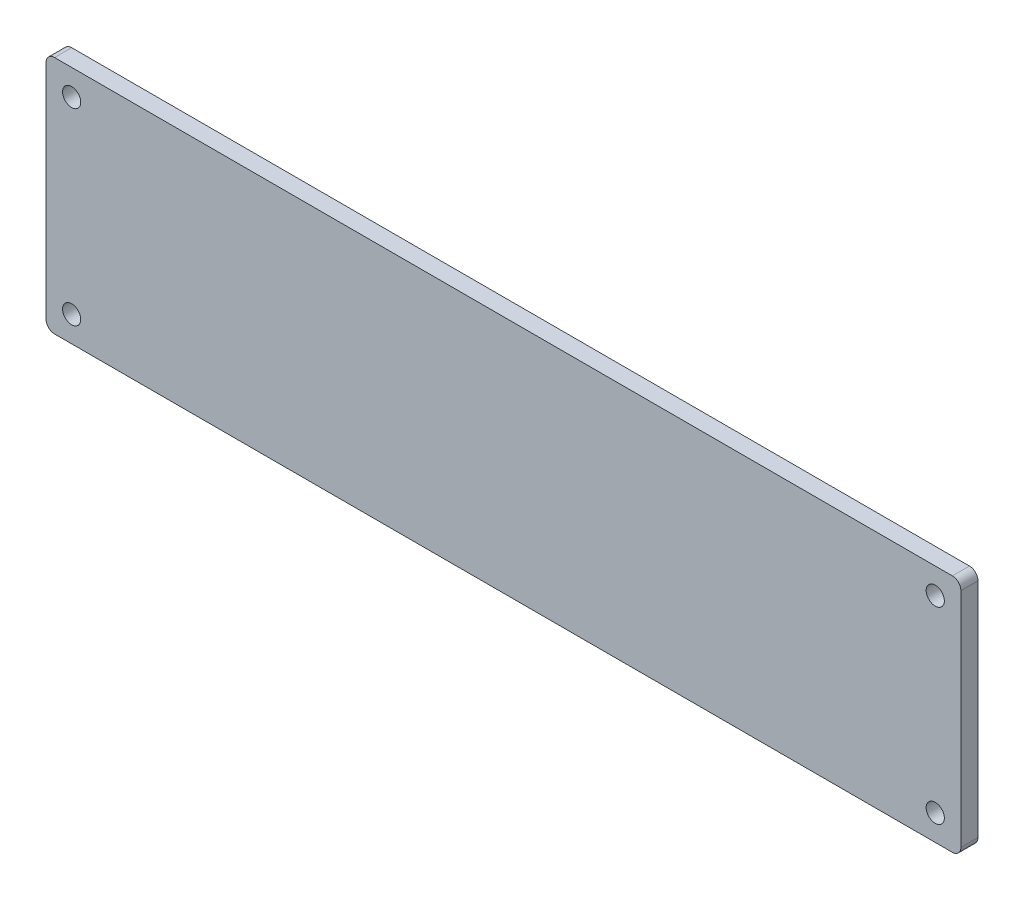
ISO-10303-21;
HEADER;
FILE_DESCRIPTION(('STEP AP214'),'2;1');
FILE_NAME('part.step','',(''),(''),'','','');
FILE_SCHEMA(('AUTOMOTIVE_DESIGN { 1 0 10303 214 1 1 1 1 }'));
ENDSEC;
DATA;
#1=APPLICATION_CONTEXT('core data for automotive mechanical design processes');
#2=APPLICATION_PROTOCOL_DEFINITION('international standard','automotive_design',2000,#1);
#3=PRODUCT_CONTEXT('',#1,'mechanical');
#4=PRODUCT('Part','Part','',(#3));
#5=PRODUCT_RELATED_PRODUCT_CATEGORY('part','',(#4));
#6=PRODUCT_DEFINITION_FORMATION('','',#4);
#7=PRODUCT_DEFINITION_CONTEXT('part definition',#1,'design');
#8=PRODUCT_DEFINITION('design','',#6,#7);
#9=PRODUCT_DEFINITION_SHAPE('','',#8);
#10=(LENGTH_UNIT() NAMED_UNIT(*) SI_UNIT(.MILLI.,.METRE.));
#11=(NAMED_UNIT(*) PLANE_ANGLE_UNIT() SI_UNIT($,.RADIAN.));
#12=(NAMED_UNIT(*) SI_UNIT($,.STERADIAN.) SOLID_ANGLE_UNIT());
#13=UNCERTAINTY_MEASURE_WITH_UNIT(LENGTH_MEASURE(1.E-05),#10,'distance_accuracy_value','');
#14=(GEOMETRIC_REPRESENTATION_CONTEXT(3) GLOBAL_UNCERTAINTY_ASSIGNED_CONTEXT((#13)) GLOBAL_UNIT_ASSIGNED_CONTEXT((#10,
#11,#12)) REPRESENTATION_CONTEXT('',''));
#15=CARTESIAN_POINT('',(0.,0.,0.));
#16=DIRECTION('',(0.,0.,1.));
#17=DIRECTION('',(1.,0.,0.));
#18=AXIS2_PLACEMENT_3D('',#15,#16,#17);
#19=CARTESIAN_POINT('',(169.8625,44.45,6.35));
#20=DIRECTION('',(1.,0.,0.));
#21=DIRECTION('',(0.,0.,-1.));
#22=AXIS2_PLACEMENT_3D('',#19,#20,#21);
#23=PLANE('',#22);
#24=DIRECTION('',(0.,-1.,0.));
#25=VECTOR('',#24,1.);
#26=CARTESIAN_POINT('',(169.8625,44.45,0.));
#27=LINE('',#26,#25);
#28=CARTESIAN_POINT('',(169.8625,41.275,0.));
#29=VERTEX_POINT('',#28);
#30=CARTESIAN_POINT('',(169.8625,-41.275,0.));
#31=VERTEX_POINT('',#30);
#32=EDGE_CURVE('E165',#29,#31,#27,.T.);
#33=ORIENTED_EDGE('',*,*,#32,.F.);
#34=DIRECTION('',(0.,0.,-1.));
#35=VECTOR('',#34,1.);
#36=CARTESIAN_POINT('',(169.8625,41.275,6.35));
#37=LINE('',#36,#35);
#38=CARTESIAN_POINT('',(169.8625,41.275,6.35));
#39=VERTEX_POINT('',#38);
#40=EDGE_CURVE('E140',#29,#39,#37,.F.);
#41=ORIENTED_EDGE('',*,*,#40,.T.);
#42=DIRECTION('',(0.,-1.,0.));
#43=VECTOR('',#42,1.);
#44=CARTESIAN_POINT('',(169.8625,44.45,6.35));
#45=LINE('',#44,#43);
#46=CARTESIAN_POINT('',(169.8625,-41.275,6.35));
#47=VERTEX_POINT('',#46);
#48=EDGE_CURVE('E121',#39,#47,#45,.T.);
#49=ORIENTED_EDGE('',*,*,#48,.T.);
#50=DIRECTION('',(0.,0.,-1.));
#51=VECTOR('',#50,1.);
#52=CARTESIAN_POINT('',(169.8625,-41.275,6.35));
#53=LINE('',#52,#51);
#54=EDGE_CURVE('E137',#47,#31,#53,.T.);
#55=ORIENTED_EDGE('',*,*,#54,.T.);
#56=EDGE_LOOP('',(#33,#41,#49,#55));
#57=FACE_BOUND('',#56,.T.);
#58=ADVANCED_FACE('F34',(#57),#23,.T.);
#59=CARTESIAN_POINT('',(-169.8625,44.45,6.35));
#60=DIRECTION('',(0.,1.,0.));
#61=DIRECTION('',(0.,0.,1.));
#62=AXIS2_PLACEMENT_3D('',#59,#60,#61);
#63=PLANE('',#62);
#64=DIRECTION('',(1.,0.,0.));
#65=VECTOR('',#64,1.);
#66=CARTESIAN_POINT('',(-169.8625,44.45,6.35));
#67=LINE('',#66,#65);
#68=CARTESIAN_POINT('',(-166.6875,44.45,6.35));
#69=VERTEX_POINT('',#68);
#70=CARTESIAN_POINT('',(166.6875,44.45,6.35));
#71=VERTEX_POINT('',#70);
#72=EDGE_CURVE('E126',#69,#71,#67,.T.);
#73=ORIENTED_EDGE('',*,*,#72,.T.);
#74=DIRECTION('',(0.,0.,-1.));
#75=VECTOR('',#74,1.);
#76=CARTESIAN_POINT('',(166.6875,44.45,6.35));
#77=LINE('',#76,#75);
#78=CARTESIAN_POINT('',(166.6875,44.45,0.));
#79=VERTEX_POINT('',#78);
#80=EDGE_CURVE('E120',#71,#79,#77,.T.);
#81=ORIENTED_EDGE('',*,*,#80,.T.);
#82=DIRECTION('',(1.,0.,0.));
#83=VECTOR('',#82,1.);
#84=CARTESIAN_POINT('',(-169.8625,44.45,0.));
#85=LINE('',#84,#83);
#86=CARTESIAN_POINT('',(-166.6875,44.45,0.));
#87=VERTEX_POINT('',#86);
#88=EDGE_CURVE('E104',#87,#79,#85,.T.);
#89=ORIENTED_EDGE('',*,*,#88,.F.);
#90=DIRECTION('',(0.,0.,-1.));
#91=VECTOR('',#90,1.);
#92=CARTESIAN_POINT('',(-166.6875,44.45,6.35));
#93=LINE('',#92,#91);
#94=EDGE_CURVE('E117',#87,#69,#93,.F.);
#95=ORIENTED_EDGE('',*,*,#94,.T.);
#96=EDGE_LOOP('',(#73,#81,#89,#95));
#97=FACE_BOUND('',#96,.T.);
#98=ADVANCED_FACE('F116',(#97),#63,.T.);
#99=CARTESIAN_POINT('',(-169.8625,-44.45,6.35));
#100=DIRECTION('',(-1.,0.,0.));
#101=DIRECTION('',(0.,0.,1.));
#102=AXIS2_PLACEMENT_3D('',#99,#100,#101);
#103=PLANE('',#102);
#104=DIRECTION('',(0.,1.,0.));
#105=VECTOR('',#104,1.);
#106=CARTESIAN_POINT('',(-169.8625,-44.45,6.35));
#107=LINE('',#106,#105);
#108=CARTESIAN_POINT('',(-169.8625,-41.275,6.35));
#109=VERTEX_POINT('',#108);
#110=CARTESIAN_POINT('',(-169.8625,41.275,6.35));
#111=VERTEX_POINT('',#110);
#112=EDGE_CURVE('E129',#109,#111,#107,.T.);
#113=ORIENTED_EDGE('',*,*,#112,.T.);
#114=DIRECTION('',(0.,0.,-1.));
#115=VECTOR('',#114,1.);
#116=CARTESIAN_POINT('',(-169.8625,41.275,6.35));
#117=LINE('',#116,#115);
#118=CARTESIAN_POINT('',(-169.8625,41.275,0.));
#119=VERTEX_POINT('',#118);
#120=EDGE_CURVE('E11',#111,#119,#117,.T.);
#121=ORIENTED_EDGE('',*,*,#120,.T.);
#122=DIRECTION('',(0.,1.,0.));
#123=VECTOR('',#122,1.);
#124=CARTESIAN_POINT('',(-169.8625,-44.45,0.));
#125=LINE('',#124,#123);
#126=CARTESIAN_POINT('',(-169.8625,-41.275,0.));
#127=VERTEX_POINT('',#126);
#128=EDGE_CURVE('E106',#127,#119,#125,.T.);
#129=ORIENTED_EDGE('',*,*,#128,.F.);
#130=DIRECTION('',(0.,0.,-1.));
#131=VECTOR('',#130,1.);
#132=CARTESIAN_POINT('',(-169.8625,-41.275,6.35));
#133=LINE('',#132,#131);
#134=EDGE_CURVE('E42',#127,#109,#133,.F.);
#135=ORIENTED_EDGE('',*,*,#134,.T.);
#136=EDGE_LOOP('',(#113,#121,#129,#135));
#137=FACE_BOUND('',#136,.T.);
#138=ADVANCED_FACE('F154',(#137),#103,.T.);
#139=CARTESIAN_POINT('',(169.8625,-44.45,6.35));
#140=DIRECTION('',(0.,-1.,0.));
#141=DIRECTION('',(0.,0.,-1.));
#142=AXIS2_PLACEMENT_3D('',#139,#140,#141);
#143=PLANE('',#142);
#144=DIRECTION('',(-1.,0.,0.));
#145=VECTOR('',#144,1.);
#146=CARTESIAN_POINT('',(169.8625,-44.45,0.));
#147=LINE('',#146,#145);
#148=CARTESIAN_POINT('',(166.6875,-44.45,0.));
#149=VERTEX_POINT('',#148);
#150=CARTESIAN_POINT('',(-166.6875,-44.45,0.));
#151=VERTEX_POINT('',#150);
#152=EDGE_CURVE('E163',#149,#151,#147,.T.);
#153=ORIENTED_EDGE('',*,*,#152,.F.);
#154=DIRECTION('',(0.,0.,-1.));
#155=VECTOR('',#154,1.);
#156=CARTESIAN_POINT('',(166.6875,-44.45,6.35));
#157=LINE('',#156,#155);
#158=CARTESIAN_POINT('',(166.6875,-44.45,6.35));
#159=VERTEX_POINT('',#158);
#160=EDGE_CURVE('E56',#149,#159,#157,.F.);
#161=ORIENTED_EDGE('',*,*,#160,.T.);
#162=DIRECTION('',(-1.,0.,0.));
#163=VECTOR('',#162,1.);
#164=CARTESIAN_POINT('',(169.8625,-44.45,6.35));
#165=LINE('',#164,#163);
#166=CARTESIAN_POINT('',(-166.6875,-44.45,6.35));
#167=VERTEX_POINT('',#166);
#168=EDGE_CURVE('E158',#159,#167,#165,.T.);
#169=ORIENTED_EDGE('',*,*,#168,.T.);
#170=DIRECTION('',(0.,0.,-1.));
#171=VECTOR('',#170,1.);
#172=CARTESIAN_POINT('',(-166.6875,-44.45,6.35));
#173=LINE('',#172,#171);
#174=EDGE_CURVE('E148',#167,#151,#173,.T.);
#175=ORIENTED_EDGE('',*,*,#174,.T.);
#176=EDGE_LOOP('',(#153,#161,#169,#175));
#177=FACE_BOUND('',#176,.T.);
#178=ADVANCED_FACE('F162',(#177),#143,.T.);
#179=CARTESIAN_POINT('',(0.,0.,6.35));
#180=DIRECTION('',(0.,0.,-1.));
#181=DIRECTION('',(-1.,0.,0.));
#182=AXIS2_PLACEMENT_3D('',#179,#180,#181);
#183=PLANE('',#182);
#184=CARTESIAN_POINT('',(-160.3375,34.925,6.35));
#185=DIRECTION('',(0.,0.,1.));
#186=DIRECTION('',(1.,0.,0.));
#187=AXIS2_PLACEMENT_3D('',#184,#185,#186);
#188=CIRCLE('',#187,3.3782);
#189=CARTESIAN_POINT('',(-156.9593,34.925,6.35));
#190=VERTEX_POINT('',#189);
#191=EDGE_CURVE('E193',#190,#190,#188,.T.);
#192=ORIENTED_EDGE('',*,*,#191,.F.);
#193=EDGE_LOOP('',(#192));
#194=FACE_BOUND('',#193,.T.);
#195=CARTESIAN_POINT('',(-160.3375,-34.925,6.35));
#196=DIRECTION('',(0.,0.,1.));
#197=DIRECTION('',(1.,0.,0.));
#198=AXIS2_PLACEMENT_3D('',#195,#196,#197);
#199=CIRCLE('',#198,3.3782);
#200=CARTESIAN_POINT('',(-156.9593,-34.925,6.35));
#201=VERTEX_POINT('',#200);
#202=EDGE_CURVE('E187',#201,#201,#199,.T.);
#203=ORIENTED_EDGE('',*,*,#202,.F.);
#204=EDGE_LOOP('',(#203));
#205=FACE_BOUND('',#204,.T.);
#206=CARTESIAN_POINT('',(160.3375,34.925,6.35));
#207=DIRECTION('',(0.,0.,1.));
#208=DIRECTION('',(1.,0.,0.));
#209=AXIS2_PLACEMENT_3D('',#206,#207,#208);
#210=CIRCLE('',#209,3.3782);
#211=CARTESIAN_POINT('',(163.7157,34.925,6.35));
#212=VERTEX_POINT('',#211);
#213=EDGE_CURVE('E181',#212,#212,#210,.T.);
#214=ORIENTED_EDGE('',*,*,#213,.F.);
#215=EDGE_LOOP('',(#214));
#216=FACE_BOUND('',#215,.T.);
#217=CARTESIAN_POINT('',(160.3375,-34.925,6.35));
#218=DIRECTION('',(0.,0.,1.));
#219=DIRECTION('',(1.,0.,0.));
#220=AXIS2_PLACEMENT_3D('',#217,#218,#219);
#221=CIRCLE('',#220,3.3782);
#222=CARTESIAN_POINT('',(163.7157,-34.925,6.35));
#223=VERTEX_POINT('',#222);
#224=EDGE_CURVE('E175',#223,#223,#221,.T.);
#225=ORIENTED_EDGE('',*,*,#224,.F.);
#226=EDGE_LOOP('',(#225));
#227=FACE_BOUND('',#226,.T.);
#228=ORIENTED_EDGE('',*,*,#48,.F.);
#229=CARTESIAN_POINT('',(166.6875,41.275,6.35));
#230=DIRECTION('',(0.,0.,-1.));
#231=DIRECTION('',(-1.,0.,0.));
#232=AXIS2_PLACEMENT_3D('',#229,#230,#231);
#233=CIRCLE('',#232,3.175);
#234=EDGE_CURVE('E146',#39,#71,#233,.F.);
#235=ORIENTED_EDGE('',*,*,#234,.T.);
#236=ORIENTED_EDGE('',*,*,#72,.F.);
#237=CARTESIAN_POINT('',(-166.6875,41.275,6.35));
#238=DIRECTION('',(0.,0.,-1.));
#239=DIRECTION('',(-1.,0.,0.));
#240=AXIS2_PLACEMENT_3D('',#237,#238,#239);
#241=CIRCLE('',#240,3.175);
#242=EDGE_CURVE('E125',#69,#111,#241,.F.);
#243=ORIENTED_EDGE('',*,*,#242,.T.);
#244=ORIENTED_EDGE('',*,*,#112,.F.);
#245=CARTESIAN_POINT('',(-166.6875,-41.275,6.35));
#246=DIRECTION('',(0.,0.,-1.));
#247=DIRECTION('',(-1.,0.,0.));
#248=AXIS2_PLACEMENT_3D('',#245,#246,#247);
#249=CIRCLE('',#248,3.175);
#250=EDGE_CURVE('E49',#109,#167,#249,.F.);
#251=ORIENTED_EDGE('',*,*,#250,.T.);
#252=ORIENTED_EDGE('',*,*,#168,.F.);
#253=CARTESIAN_POINT('',(166.6875,-41.275,6.35));
#254=DIRECTION('',(0.,0.,-1.));
#255=DIRECTION('',(-1.,0.,0.));
#256=AXIS2_PLACEMENT_3D('',#253,#254,#255);
#257=CIRCLE('',#256,3.175);
#258=EDGE_CURVE('E144',#159,#47,#257,.F.);
#259=ORIENTED_EDGE('',*,*,#258,.T.);
#260=EDGE_LOOP('',(#228,#235,#236,#243,#244,#251,#252,#259));
#261=FACE_BOUND('',#260,.T.);
#262=ADVANCED_FACE('F157',(#194,#205,#216,#227,#261),#183,.F.);
#263=CARTESIAN_POINT('',(0.,0.,0.));
#264=DIRECTION('',(0.,0.,-1.));
#265=DIRECTION('',(-1.,0.,0.));
#266=AXIS2_PLACEMENT_3D('',#263,#264,#265);
#267=PLANE('',#266);
#268=CARTESIAN_POINT('',(-160.3375,34.925,0.));
#269=DIRECTION('',(0.,0.,1.));
#270=DIRECTION('',(1.,0.,0.));
#271=AXIS2_PLACEMENT_3D('',#268,#269,#270);
#272=CIRCLE('',#271,3.3782);
#273=CARTESIAN_POINT('',(-156.9593,34.925,0.));
#274=VERTEX_POINT('',#273);
#275=EDGE_CURVE('E190',#274,#274,#272,.T.);
#276=ORIENTED_EDGE('',*,*,#275,.T.);
#277=EDGE_LOOP('',(#276));
#278=FACE_BOUND('',#277,.T.);
#279=CARTESIAN_POINT('',(-160.3375,-34.925,0.));
#280=DIRECTION('',(0.,0.,1.));
#281=DIRECTION('',(1.,0.,0.));
#282=AXIS2_PLACEMENT_3D('',#279,#280,#281);
#283=CIRCLE('',#282,3.3782);
#284=CARTESIAN_POINT('',(-156.9593,-34.925,0.));
#285=VERTEX_POINT('',#284);
#286=EDGE_CURVE('E184',#285,#285,#283,.T.);
#287=ORIENTED_EDGE('',*,*,#286,.T.);
#288=EDGE_LOOP('',(#287));
#289=FACE_BOUND('',#288,.T.);
#290=CARTESIAN_POINT('',(160.3375,34.925,0.));
#291=DIRECTION('',(0.,0.,1.));
#292=DIRECTION('',(1.,0.,0.));
#293=AXIS2_PLACEMENT_3D('',#290,#291,#292);
#294=CIRCLE('',#293,3.3782);
#295=CARTESIAN_POINT('',(163.7157,34.925,0.));
#296=VERTEX_POINT('',#295);
#297=EDGE_CURVE('E178',#296,#296,#294,.T.);
#298=ORIENTED_EDGE('',*,*,#297,.T.);
#299=EDGE_LOOP('',(#298));
#300=FACE_BOUND('',#299,.T.);
#301=CARTESIAN_POINT('',(160.3375,-34.925,0.));
#302=DIRECTION('',(0.,0.,1.));
#303=DIRECTION('',(1.,0.,0.));
#304=AXIS2_PLACEMENT_3D('',#301,#302,#303);
#305=CIRCLE('',#304,3.3782);
#306=CARTESIAN_POINT('',(163.7157,-34.925,0.));
#307=VERTEX_POINT('',#306);
#308=EDGE_CURVE('E167',#307,#307,#305,.T.);
#309=ORIENTED_EDGE('',*,*,#308,.T.);
#310=EDGE_LOOP('',(#309));
#311=FACE_BOUND('',#310,.T.);
#312=ORIENTED_EDGE('',*,*,#88,.T.);
#313=CARTESIAN_POINT('',(166.6875,41.275,0.));
#314=DIRECTION('',(0.,0.,-1.));
#315=DIRECTION('',(-1.,0.,0.));
#316=AXIS2_PLACEMENT_3D('',#313,#314,#315);
#317=CIRCLE('',#316,3.175);
#318=EDGE_CURVE('E135',#79,#29,#317,.T.);
#319=ORIENTED_EDGE('',*,*,#318,.T.);
#320=ORIENTED_EDGE('',*,*,#32,.T.);
#321=CARTESIAN_POINT('',(166.6875,-41.275,0.));
#322=DIRECTION('',(0.,0.,-1.));
#323=DIRECTION('',(-1.,0.,0.));
#324=AXIS2_PLACEMENT_3D('',#321,#322,#323);
#325=CIRCLE('',#324,3.175);
#326=EDGE_CURVE('E110',#31,#149,#325,.T.);
#327=ORIENTED_EDGE('',*,*,#326,.T.);
#328=ORIENTED_EDGE('',*,*,#152,.T.);
#329=CARTESIAN_POINT('',(-166.6875,-41.275,0.));
#330=DIRECTION('',(0.,0.,-1.));
#331=DIRECTION('',(-1.,0.,0.));
#332=AXIS2_PLACEMENT_3D('',#329,#330,#331);
#333=CIRCLE('',#332,3.175);
#334=EDGE_CURVE('E111',#151,#127,#333,.T.);
#335=ORIENTED_EDGE('',*,*,#334,.T.);
#336=ORIENTED_EDGE('',*,*,#128,.T.);
#337=CARTESIAN_POINT('',(-166.6875,41.275,0.));
#338=DIRECTION('',(0.,0.,-1.));
#339=DIRECTION('',(-1.,0.,0.));
#340=AXIS2_PLACEMENT_3D('',#337,#338,#339);
#341=CIRCLE('',#340,3.175);
#342=EDGE_CURVE('E101',#119,#87,#341,.T.);
#343=ORIENTED_EDGE('',*,*,#342,.T.);
#344=EDGE_LOOP('',(#312,#319,#320,#327,#328,#335,#336,#343));
#345=FACE_BOUND('',#344,.T.);
#346=ADVANCED_FACE('F103',(#278,#289,#300,#311,#345),#267,.T.);
#347=CARTESIAN_POINT('',(160.3375,-34.925,6.35));
#348=DIRECTION('',(0.,0.,1.));
#349=DIRECTION('',(1.,0.,0.));
#350=AXIS2_PLACEMENT_3D('',#347,#348,#349);
#351=CYLINDRICAL_SURFACE('',#350,3.3782);
#352=ORIENTED_EDGE('',*,*,#308,.F.);
#353=EDGE_LOOP('',(#352));
#354=FACE_BOUND('',#353,.T.);
#355=ORIENTED_EDGE('',*,*,#224,.T.);
#356=EDGE_LOOP('',(#355));
#357=FACE_BOUND('',#356,.T.);
#358=ADVANCED_FACE('F208',(#354,#357),#351,.F.);
#359=CARTESIAN_POINT('',(160.3375,34.925,6.35));
#360=DIRECTION('',(0.,0.,1.));
#361=DIRECTION('',(1.,0.,0.));
#362=AXIS2_PLACEMENT_3D('',#359,#360,#361);
#363=CYLINDRICAL_SURFACE('',#362,3.3782);
#364=ORIENTED_EDGE('',*,*,#297,.F.);
#365=EDGE_LOOP('',(#364));
#366=FACE_BOUND('',#365,.T.);
#367=ORIENTED_EDGE('',*,*,#213,.T.);
#368=EDGE_LOOP('',(#367));
#369=FACE_BOUND('',#368,.T.);
#370=ADVANCED_FACE('F210',(#366,#369),#363,.F.);
#371=CARTESIAN_POINT('',(-160.3375,-34.925,6.35));
#372=DIRECTION('',(0.,0.,1.));
#373=DIRECTION('',(1.,0.,0.));
#374=AXIS2_PLACEMENT_3D('',#371,#372,#373);
#375=CYLINDRICAL_SURFACE('',#374,3.3782);
#376=ORIENTED_EDGE('',*,*,#286,.F.);
#377=EDGE_LOOP('',(#376));
#378=FACE_BOUND('',#377,.T.);
#379=ORIENTED_EDGE('',*,*,#202,.T.);
#380=EDGE_LOOP('',(#379));
#381=FACE_BOUND('',#380,.T.);
#382=ADVANCED_FACE('F217',(#378,#381),#375,.F.);
#383=CARTESIAN_POINT('',(-160.3375,34.925,6.35));
#384=DIRECTION('',(0.,0.,1.));
#385=DIRECTION('',(1.,0.,0.));
#386=AXIS2_PLACEMENT_3D('',#383,#384,#385);
#387=CYLINDRICAL_SURFACE('',#386,3.3782);
#388=ORIENTED_EDGE('',*,*,#275,.F.);
#389=EDGE_LOOP('',(#388));
#390=FACE_BOUND('',#389,.T.);
#391=ORIENTED_EDGE('',*,*,#191,.T.);
#392=EDGE_LOOP('',(#391));
#393=FACE_BOUND('',#392,.T.);
#394=ADVANCED_FACE('F197',(#390,#393),#387,.F.);
#395=CARTESIAN_POINT('',(166.6875,41.275,6.35));
#396=DIRECTION('',(0.,0.,-1.));
#397=DIRECTION('',(-1.,0.,0.));
#398=AXIS2_PLACEMENT_3D('',#395,#396,#397);
#399=CYLINDRICAL_SURFACE('',#398,3.175);
#400=ORIENTED_EDGE('',*,*,#234,.F.);
#401=ORIENTED_EDGE('',*,*,#40,.F.);
#402=ORIENTED_EDGE('',*,*,#318,.F.);
#403=ORIENTED_EDGE('',*,*,#80,.F.);
#404=EDGE_LOOP('',(#400,#401,#402,#403));
#405=FACE_BOUND('',#404,.T.);
#406=ADVANCED_FACE('F234',(#405),#399,.T.);
#407=CARTESIAN_POINT('',(166.6875,-41.275,6.35));
#408=DIRECTION('',(0.,0.,-1.));
#409=DIRECTION('',(-1.,0.,0.));
#410=AXIS2_PLACEMENT_3D('',#407,#408,#409);
#411=CYLINDRICAL_SURFACE('',#410,3.175);
#412=ORIENTED_EDGE('',*,*,#258,.F.);
#413=ORIENTED_EDGE('',*,*,#160,.F.);
#414=ORIENTED_EDGE('',*,*,#326,.F.);
#415=ORIENTED_EDGE('',*,*,#54,.F.);
#416=EDGE_LOOP('',(#412,#413,#414,#415));
#417=FACE_BOUND('',#416,.T.);
#418=ADVANCED_FACE('F237',(#417),#411,.T.);
#419=CARTESIAN_POINT('',(-166.6875,41.275,6.35));
#420=DIRECTION('',(0.,0.,-1.));
#421=DIRECTION('',(-1.,0.,0.));
#422=AXIS2_PLACEMENT_3D('',#419,#420,#421);
#423=CYLINDRICAL_SURFACE('',#422,3.175);
#424=ORIENTED_EDGE('',*,*,#242,.F.);
#425=ORIENTED_EDGE('',*,*,#94,.F.);
#426=ORIENTED_EDGE('',*,*,#342,.F.);
#427=ORIENTED_EDGE('',*,*,#120,.F.);
#428=EDGE_LOOP('',(#424,#425,#426,#427));
#429=FACE_BOUND('',#428,.T.);
#430=ADVANCED_FACE('F124',(#429),#423,.T.);
#431=CARTESIAN_POINT('',(-166.6875,-41.275,6.35));
#432=DIRECTION('',(0.,0.,-1.));
#433=DIRECTION('',(-1.,0.,0.));
#434=AXIS2_PLACEMENT_3D('',#431,#432,#433);
#435=CYLINDRICAL_SURFACE('',#434,3.175);
#436=ORIENTED_EDGE('',*,*,#250,.F.);
#437=ORIENTED_EDGE('',*,*,#134,.F.);
#438=ORIENTED_EDGE('',*,*,#334,.F.);
#439=ORIENTED_EDGE('',*,*,#174,.F.);
#440=EDGE_LOOP('',(#436,#437,#438,#439));
#441=FACE_BOUND('',#440,.T.);
#442=ADVANCED_FACE('F36',(#441),#435,.T.);
#443=CLOSED_SHELL('',(#58,#98,#138,#178,#262,#346,#358,#370,#382,#394,#406,#418,#430,#442));
#444=MANIFOLD_SOLID_BREP('B2',#443);
#445=ADVANCED_BREP_SHAPE_REPRESENTATION('',(#18,#444),#14);
#446=SHAPE_DEFINITION_REPRESENTATION(#9,#445);
ENDSEC;
END-ISO-10303-21;
